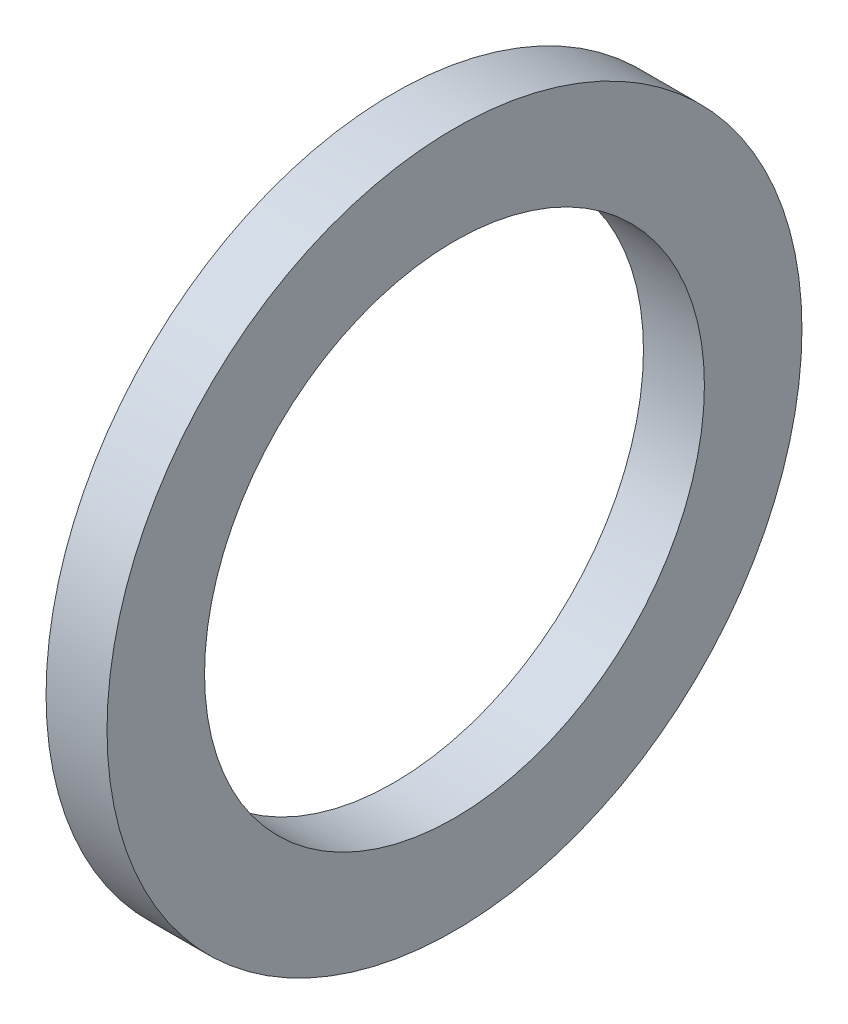
ISO-10303-21;
HEADER;
FILE_DESCRIPTION(('STEP AP214'),'2;1');
FILE_NAME('part.step','',(''),(''),'','','');
FILE_SCHEMA(('AUTOMOTIVE_DESIGN { 1 0 10303 214 1 1 1 1 }'));
ENDSEC;
DATA;
#1=APPLICATION_CONTEXT('core data for automotive mechanical design processes');
#2=APPLICATION_PROTOCOL_DEFINITION('international standard','automotive_design',2000,#1);
#3=PRODUCT_CONTEXT('',#1,'mechanical');
#4=PRODUCT('Part','Part','',(#3));
#5=PRODUCT_RELATED_PRODUCT_CATEGORY('part','',(#4));
#6=PRODUCT_DEFINITION_FORMATION('','',#4);
#7=PRODUCT_DEFINITION_CONTEXT('part definition',#1,'design');
#8=PRODUCT_DEFINITION('design','',#6,#7);
#9=PRODUCT_DEFINITION_SHAPE('','',#8);
#10=(LENGTH_UNIT() NAMED_UNIT(*) SI_UNIT(.MILLI.,.METRE.));
#11=(NAMED_UNIT(*) PLANE_ANGLE_UNIT() SI_UNIT($,.RADIAN.));
#12=(NAMED_UNIT(*) SI_UNIT($,.STERADIAN.) SOLID_ANGLE_UNIT());
#13=UNCERTAINTY_MEASURE_WITH_UNIT(LENGTH_MEASURE(1.E-05),#10,'distance_accuracy_value','');
#14=(GEOMETRIC_REPRESENTATION_CONTEXT(3) GLOBAL_UNCERTAINTY_ASSIGNED_CONTEXT((#13)) GLOBAL_UNIT_ASSIGNED_CONTEXT((#10,
#11,#12)) REPRESENTATION_CONTEXT('',''));
#15=CARTESIAN_POINT('',(0.,0.,0.));
#16=DIRECTION('',(0.,0.,1.));
#17=DIRECTION('',(1.,0.,0.));
#18=AXIS2_PLACEMENT_3D('',#15,#16,#17);
#19=CARTESIAN_POINT('',(-0.5,5.7,0.));
#20=DIRECTION('',(-1.,0.,0.));
#21=DIRECTION('',(0.,0.,1.));
#22=AXIS2_PLACEMENT_3D('',#19,#20,#21);
#23=PLANE('',#22);
#24=CARTESIAN_POINT('',(-0.5,0.,0.));
#25=DIRECTION('',(1.,0.,0.));
#26=DIRECTION('',(0.,0.,-1.));
#27=AXIS2_PLACEMENT_3D('',#24,#25,#26);
#28=CIRCLE('',#27,4.1);
#29=CARTESIAN_POINT('',(-0.5,0.,-4.1));
#30=VERTEX_POINT('',#29);
#31=EDGE_CURVE('E9',#30,#30,#28,.T.);
#32=ORIENTED_EDGE('',*,*,#31,.T.);
#33=EDGE_LOOP('',(#32));
#34=FACE_BOUND('',#33,.T.);
#35=CARTESIAN_POINT('',(-0.5,0.,0.));
#36=DIRECTION('',(1.,0.,0.));
#37=DIRECTION('',(0.,0.,-1.));
#38=AXIS2_PLACEMENT_3D('',#35,#36,#37);
#39=CIRCLE('',#38,5.7);
#40=CARTESIAN_POINT('',(-0.5,0.,-5.7));
#41=VERTEX_POINT('',#40);
#42=EDGE_CURVE('E28',#41,#41,#39,.T.);
#43=ORIENTED_EDGE('',*,*,#42,.F.);
#44=EDGE_LOOP('',(#43));
#45=FACE_BOUND('',#44,.T.);
#46=ADVANCED_FACE('F14',(#34,#45),#23,.T.);
#47=CARTESIAN_POINT('',(0.5,0.,0.));
#48=DIRECTION('',(1.,0.,0.));
#49=DIRECTION('',(0.,0.,-1.));
#50=AXIS2_PLACEMENT_3D('',#47,#48,#49);
#51=CYLINDRICAL_SURFACE('',#50,4.1);
#52=CARTESIAN_POINT('',(0.5,0.,0.));
#53=DIRECTION('',(1.,0.,0.));
#54=DIRECTION('',(0.,0.,-1.));
#55=AXIS2_PLACEMENT_3D('',#52,#53,#54);
#56=CIRCLE('',#55,4.1);
#57=CARTESIAN_POINT('',(0.5,0.,-4.1));
#58=VERTEX_POINT('',#57);
#59=EDGE_CURVE('E20',#58,#58,#56,.T.);
#60=ORIENTED_EDGE('',*,*,#59,.T.);
#61=EDGE_LOOP('',(#60));
#62=FACE_BOUND('',#61,.T.);
#63=ORIENTED_EDGE('',*,*,#31,.F.);
#64=EDGE_LOOP('',(#63));
#65=FACE_BOUND('',#64,.T.);
#66=ADVANCED_FACE('F38',(#62,#65),#51,.F.);
#67=CARTESIAN_POINT('',(0.5,4.1,0.));
#68=DIRECTION('',(1.,0.,0.));
#69=DIRECTION('',(0.,0.,-1.));
#70=AXIS2_PLACEMENT_3D('',#67,#68,#69);
#71=PLANE('',#70);
#72=CARTESIAN_POINT('',(0.5,0.,0.));
#73=DIRECTION('',(1.,0.,0.));
#74=DIRECTION('',(0.,0.,-1.));
#75=AXIS2_PLACEMENT_3D('',#72,#73,#74);
#76=CIRCLE('',#75,5.7);
#77=CARTESIAN_POINT('',(0.5,0.,-5.7));
#78=VERTEX_POINT('',#77);
#79=EDGE_CURVE('E24',#78,#78,#76,.T.);
#80=ORIENTED_EDGE('',*,*,#79,.T.);
#81=EDGE_LOOP('',(#80));
#82=FACE_BOUND('',#81,.T.);
#83=ORIENTED_EDGE('',*,*,#59,.F.);
#84=EDGE_LOOP('',(#83));
#85=FACE_BOUND('',#84,.T.);
#86=ADVANCED_FACE('F43',(#82,#85),#71,.T.);
#87=CARTESIAN_POINT('',(0.5,0.,0.));
#88=DIRECTION('',(1.,0.,0.));
#89=DIRECTION('',(0.,0.,-1.));
#90=AXIS2_PLACEMENT_3D('',#87,#88,#89);
#91=CYLINDRICAL_SURFACE('',#90,5.7);
#92=ORIENTED_EDGE('',*,*,#42,.T.);
#93=EDGE_LOOP('',(#92));
#94=FACE_BOUND('',#93,.T.);
#95=ORIENTED_EDGE('',*,*,#79,.F.);
#96=EDGE_LOOP('',(#95));
#97=FACE_BOUND('',#96,.T.);
#98=ADVANCED_FACE('F34',(#94,#97),#91,.T.);
#99=CLOSED_SHELL('',(#46,#66,#86,#98));
#100=MANIFOLD_SOLID_BREP('B1',#99);
#101=ADVANCED_BREP_SHAPE_REPRESENTATION('',(#18,#100),#14);
#102=SHAPE_DEFINITION_REPRESENTATION(#9,#101);
ENDSEC;
END-ISO-10303-21;
